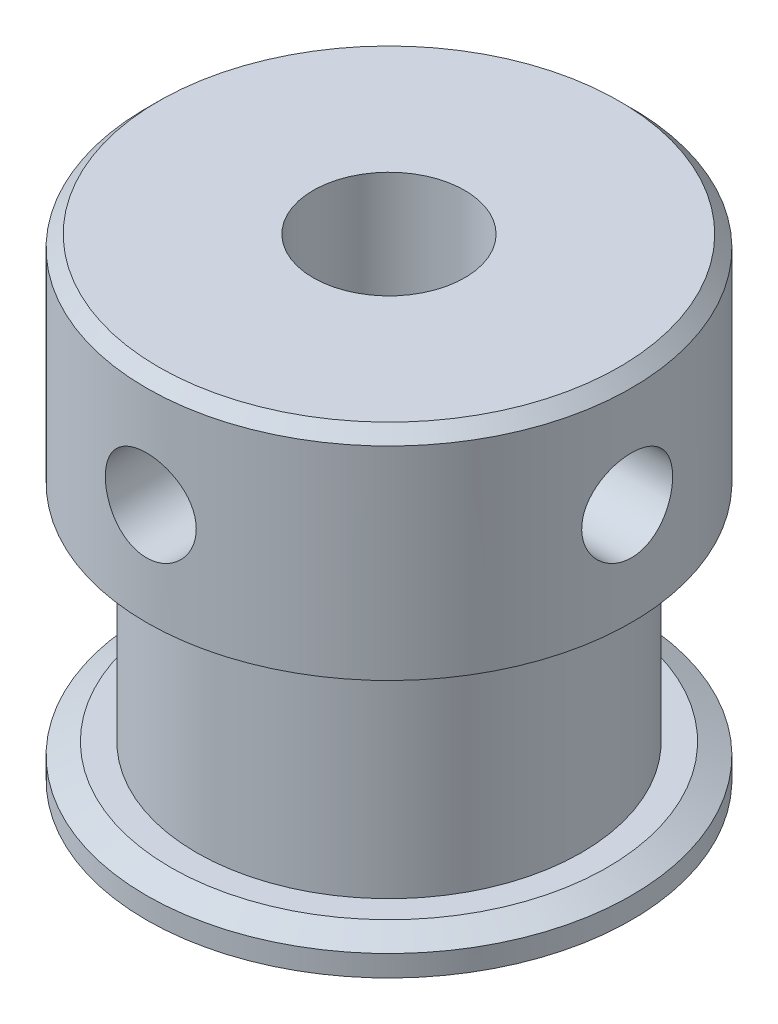
ISO-10303-21;
HEADER;
FILE_DESCRIPTION(('STEP AP214'),'2;1');
FILE_NAME('part.step','',(''),(''),'','','');
FILE_SCHEMA(('AUTOMOTIVE_DESIGN { 1 0 10303 214 1 1 1 1 }'));
ENDSEC;
DATA;
#1=APPLICATION_CONTEXT('core data for automotive mechanical design processes');
#2=APPLICATION_PROTOCOL_DEFINITION('international standard','automotive_design',2000,#1);
#3=PRODUCT_CONTEXT('',#1,'mechanical');
#4=PRODUCT('Part','Part','',(#3));
#5=PRODUCT_RELATED_PRODUCT_CATEGORY('part','',(#4));
#6=PRODUCT_DEFINITION_FORMATION('','',#4);
#7=PRODUCT_DEFINITION_CONTEXT('part definition',#1,'design');
#8=PRODUCT_DEFINITION('design','',#6,#7);
#9=PRODUCT_DEFINITION_SHAPE('','',#8);
#10=(LENGTH_UNIT() NAMED_UNIT(*) SI_UNIT(.MILLI.,.METRE.));
#11=(NAMED_UNIT(*) PLANE_ANGLE_UNIT() SI_UNIT($,.RADIAN.));
#12=(NAMED_UNIT(*) SI_UNIT($,.STERADIAN.) SOLID_ANGLE_UNIT());
#13=UNCERTAINTY_MEASURE_WITH_UNIT(LENGTH_MEASURE(1.E-05),#10,'distance_accuracy_value','');
#14=(GEOMETRIC_REPRESENTATION_CONTEXT(3) GLOBAL_UNCERTAINTY_ASSIGNED_CONTEXT((#13)) GLOBAL_UNIT_ASSIGNED_CONTEXT((#10,
#11,#12)) REPRESENTATION_CONTEXT('',''));
#15=CARTESIAN_POINT('',(0.,0.,0.));
#16=DIRECTION('',(0.,0.,1.));
#17=DIRECTION('',(1.,0.,0.));
#18=AXIS2_PLACEMENT_3D('',#15,#16,#17);
#19=CARTESIAN_POINT('',(0.,-3.15877434078088,0.));
#20=DIRECTION('',(0.,1.,0.));
#21=DIRECTION('',(0.,0.,1.));
#22=AXIS2_PLACEMENT_3D('',#19,#20,#21);
#23=CYLINDRICAL_SURFACE('',#22,2.5);
#24=CARTESIAN_POINT('',(0.,2.74999999999997,2.50000000000003));
#25=CARTESIAN_POINT('',(0.076729833462015,2.75000409100986,2.4999962578974));
#26=CARTESIAN_POINT('',(0.153582320644176,2.75592867092624,2.49642904615011));
#27=CARTESIAN_POINT('',(0.304975509530677,2.77932431951531,2.48249903608566));
#28=CARTESIAN_POINT('',(0.379510034596046,2.79682386185422,2.4721194803272));
#29=CARTESIAN_POINT('',(0.523751827790836,2.84238636116685,2.44561558054491));
#30=CARTESIAN_POINT('',(0.593481028226565,2.87039695816314,2.42951973272944));
#31=CARTESIAN_POINT('',(0.727030318214651,2.93586033314101,2.39295367626407));
#32=CARTESIAN_POINT('',(0.790851869416369,2.97331076696874,2.37248455380255));
#33=CARTESIAN_POINT('',(0.916299278999303,3.05977482670857,2.32705360719088));
#34=CARTESIAN_POINT('',(0.977384020081412,3.10945369535137,2.30186792195984));
#35=CARTESIAN_POINT('',(1.09088270411891,3.21746720382826,2.25030439279635));
#36=CARTESIAN_POINT('',(1.14328534948111,3.27581293718733,2.22392505153574));
#37=CARTESIAN_POINT('',(1.24444996762972,3.40792351049675,2.16911066995913));
#38=CARTESIAN_POINT('',(1.29197766378808,3.48270177098128,2.14082017703649));
#39=CARTESIAN_POINT('',(1.37361437764896,3.6408465732431,2.08938301412125));
#40=CARTESIAN_POINT('',(1.40774517335159,3.72419889624756,2.06622802273943));
#41=CARTESIAN_POINT('',(1.4544060171422,3.87659645065323,2.03354629660935));
#42=CARTESIAN_POINT('',(1.47016197246825,3.9442359986103,2.02207883137593));
#43=CARTESIAN_POINT('',(1.49216172340474,4.08180371583035,2.00590308295503));
#44=CARTESIAN_POINT('',(1.49841734556835,4.15172892875448,2.00118639643761));
#45=CARTESIAN_POINT('',(1.50105508796007,4.29201149421734,1.99920922463858));
#46=CARTESIAN_POINT('',(1.49741783408416,4.3623694250932,2.00196337012719));
#47=CARTESIAN_POINT('',(1.48046060478826,4.5012787754276,2.01453261443743));
#48=CARTESIAN_POINT('',(1.46713334620103,4.56982879584747,2.02435302432229));
#49=CARTESIAN_POINT('',(1.43173921881792,4.70253024212812,2.04953186944262));
#50=CARTESIAN_POINT('',(1.40978748666085,4.76672705392449,2.0648171165254));
#51=CARTESIAN_POINT('',(1.35795061770834,4.89069499092811,2.09927051350829));
#52=CARTESIAN_POINT('',(1.32806257259704,4.95046448342391,2.11844008623465));
#53=CARTESIAN_POINT('',(1.25517983184582,5.07498409712279,2.16255327268985));
#54=CARTESIAN_POINT('',(1.21080724397721,5.13877809295491,2.18792043372992));
#55=CARTESIAN_POINT('',(1.11291092784001,5.258676483667,2.23930599764383));
#56=CARTESIAN_POINT('',(1.05937845100577,5.3147734339765,2.26532500262153));
#57=CARTESIAN_POINT('',(0.935811834382951,5.42561298182175,2.3193550495832));
#58=CARTESIAN_POINT('',(0.864517682704924,5.47907730601597,2.34713836268533));
#59=CARTESIAN_POINT('',(0.712276050458969,5.5731220471979,2.39772428433982));
#60=CARTESIAN_POINT('',(0.631333763943552,5.61370935378997,2.4205295542552));
#61=CARTESIAN_POINT('',(0.467197585268199,5.6779321827959,2.45730392066155));
#62=CARTESIAN_POINT('',(0.384467624173561,5.70247535571589,2.47173957439704));
#63=CARTESIAN_POINT('',(0.215047895144617,5.73701119740536,2.49218842813551));
#64=CARTESIAN_POINT('',(0.128363005661304,5.74702131775358,2.49821172952742));
#65=CARTESIAN_POINT('',(-0.0337146143774014,5.75150784767831,2.50090570374615));
#66=CARTESIAN_POINT('',(-0.109042473418721,5.74790885508515,2.49873521714287));
#67=CARTESIAN_POINT('',(-0.257829401986068,5.72957414692806,2.48778712087047));
#68=CARTESIAN_POINT('',(-0.33128850937612,5.7148386571942,2.47900964518037));
#69=CARTESIAN_POINT('',(-0.472574932157623,5.67545656718755,2.4559479244219));
#70=CARTESIAN_POINT('',(-0.540495750928484,5.65105965092652,2.44180275662555));
#71=CARTESIAN_POINT('',(-0.671265749087264,5.59332262363471,2.40913880862845));
#72=CARTESIAN_POINT('',(-0.734113924963921,5.55998074865332,2.39061916586514));
#73=CARTESIAN_POINT('',(-0.860006262823877,5.48144302079129,2.34845496237363));
#74=CARTESIAN_POINT('',(-0.922394150456837,5.4353761709216,2.3244780273988));
#75=CARTESIAN_POINT('',(-1.03902603131013,5.33460860651137,2.27474265574732));
#76=CARTESIAN_POINT('',(-1.09326040273739,5.27989784514745,2.24898216586363));
#77=CARTESIAN_POINT('',(-1.1993199673558,5.15508960996284,2.19445423909894));
#78=CARTESIAN_POINT('',(-1.24991019630915,5.0839161145345,2.16573241746291));
#79=CARTESIAN_POINT('',(-1.33845238915667,4.9327839754318,2.1121618206671));
#80=CARTESIAN_POINT('',(-1.37641766769781,4.85283470610722,2.08730897997693));
#81=CARTESIAN_POINT('',(-1.43142578795777,4.70375697769332,2.04984909240521));
#82=CARTESIAN_POINT('',(-1.45121625336191,4.63601968764142,2.03575659328728));
#83=CARTESIAN_POINT('',(-1.48113663905972,4.49746792191989,2.01409605743543));
#84=CARTESIAN_POINT('',(-1.4912799529763,4.42665785567216,2.00651897642724));
#85=CARTESIAN_POINT('',(-1.50134130416631,4.28362305240295,1.9990044661627));
#86=CARTESIAN_POINT('',(-1.50122089107871,4.21139400931294,1.99909576445936));
#87=CARTESIAN_POINT('',(-1.49066472959329,4.06810556439055,2.00697717892849));
#88=CARTESIAN_POINT('',(-1.48022337215759,3.99704681991942,2.01477148138824));
#89=CARTESIAN_POINT('',(-1.45040174148913,3.86151158242783,2.03633185242984));
#90=CARTESIAN_POINT('',(-1.43147636845353,3.79688290569313,2.0497921180558));
#91=CARTESIAN_POINT('',(-1.38563242076995,3.67166274552577,2.08105501960149));
#92=CARTESIAN_POINT('',(-1.35871083588481,3.61107279303944,2.09885929040482));
#93=CARTESIAN_POINT('',(-1.29289245555734,3.48568014277921,2.14012990550917));
#94=CARTESIAN_POINT('',(-1.25279167675755,3.42165889614567,2.16404587582638));
#95=CARTESIAN_POINT('',(-1.16375698389086,3.3006199273827,2.21320127030767));
#96=CARTESIAN_POINT('',(-1.11481579607798,3.24360803784746,2.23844177205024));
#97=CARTESIAN_POINT('',(-1.00009777425734,3.12864905086834,2.29225690291479));
#98=CARTESIAN_POINT('',(-0.932876819313919,3.07206892510379,2.32070308663656));
#99=CARTESIAN_POINT('',(-0.788462434445615,2.97090214413668,2.37365428872367));
#100=CARTESIAN_POINT('',(-0.71126544450156,2.92631978801523,2.39815789310941));
#101=CARTESIAN_POINT('',(-0.551125230801472,2.85221419242628,2.43985578654398));
#102=CARTESIAN_POINT('',(-0.468430086957235,2.82227193507315,2.45725077479784));
#103=CARTESIAN_POINT('',(-0.29797330611883,2.777275304789,2.48366273001248));
#104=CARTESIAN_POINT('',(-0.210232099648633,2.76216483214303,2.49271125871498));
#105=CARTESIAN_POINT('',(-0.10155809691755,2.75330254529133,2.4980200116819));
#106=CARTESIAN_POINT('',(-0.0812762590282881,2.75206558269388,2.49876114656362));
#107=CARTESIAN_POINT('',(-0.0406658206871173,2.75041375362911,2.49975164517366));
#108=CARTESIAN_POINT('',(-0.0203372186375719,2.74999891567907,2.50000099184317));
#109=CARTESIAN_POINT('',(0.,2.74999999999997,2.50000000000003));
#110=B_SPLINE_CURVE_WITH_KNOTS('',3,(#24,#25,#26,#27,#28,#29,#30,#31,#32,#33,#34,#35,#36,#37,
#38,#39,#40,#41,#42,#43,#44,#45,#46,#47,#48,#49,#50,#51,#52,#53,#54,#55,#56,#57,#58,#59,#60,#61,
#62,#63,#64,#65,#66,#67,#68,#69,#70,#71,#72,#73,#74,#75,#76,#77,#78,#79,#80,#81,#82,#83,#84,#85,
#86,#87,#88,#89,#90,#91,#92,#93,#94,#95,#96,#97,#98,#99,#100,#101,#102,#103,#104,#105,#106,#107,
#108,#109),.UNSPECIFIED.,.T.,.F.,(4,2,2,2,2,2,2,2,2,2,2,2,2,2,2,2,2,2,2,2,2,2,2,2,2,2,2,2,2,2,2,
2,2,2,2,2,2,2,2,2,2,2,4),(0.,0.230102237548649,0.460772627520015,0.690308884600011,
0.919788197992268,1.16681590732472,1.41416257934801,1.69183813189807,1.9690604069209,
2.17933829855632,2.38935420916577,2.59978170870727,2.81036753273875,3.01823267593207,
3.22617409809866,3.47046995225161,3.71500044803674,3.99360957884691,4.27206939275324,
4.53296790696559,4.79355286918235,5.01875602722425,5.24395461863454,5.4636778568977,
5.68344445659024,5.9260136581836,6.16886690081834,6.44336762428007,6.71757792616452,
6.93257787314691,7.14727888733318,7.36278425777431,7.57840681155721,7.78364098331139,
7.98895251523033,8.22578610052284,8.46281544370206,8.73854311775516,9.01436946031982,
9.28175654462674,9.54812832184446,9.60911473335176,9.6701032602764),.UNSPECIFIED.);
#111=CARTESIAN_POINT('',(0.,2.74999999999997,2.50000000000003));
#112=VERTEX_POINT('',#111);
#113=EDGE_CURVE('E65',#112,#112,#110,.T.);
#114=ORIENTED_EDGE('',*,*,#113,.T.);
#115=EDGE_LOOP('',(#114));
#116=FACE_BOUND('',#115,.T.);
#117=CARTESIAN_POINT('',(0.,8.00000000000001,0.));
#118=DIRECTION('',(0.,1.,0.));
#119=DIRECTION('',(0.,0.,1.));
#120=AXIS2_PLACEMENT_3D('',#117,#118,#119);
#121=CIRCLE('',#120,2.5);
#122=CARTESIAN_POINT('',(0.,8.00000000000001,2.5));
#123=VERTEX_POINT('',#122);
#124=EDGE_CURVE('E143',#123,#123,#121,.T.);
#125=ORIENTED_EDGE('',*,*,#124,.T.);
#126=EDGE_LOOP('',(#125));
#127=FACE_BOUND('',#126,.T.);
#128=CARTESIAN_POINT('',(0.,-8.00000000000001,0.));
#129=DIRECTION('',(0.,1.,0.));
#130=DIRECTION('',(0.,0.,1.));
#131=AXIS2_PLACEMENT_3D('',#128,#129,#130);
#132=CIRCLE('',#131,2.5);
#133=CARTESIAN_POINT('',(0.,-8.00000000000001,2.5));
#134=VERTEX_POINT('',#133);
#135=EDGE_CURVE('E146',#134,#134,#132,.T.);
#136=ORIENTED_EDGE('',*,*,#135,.F.);
#137=EDGE_LOOP('',(#136));
#138=FACE_BOUND('',#137,.T.);
#139=CARTESIAN_POINT('',(2.,4.24999999999998,-1.49999999999997));
#140=CARTESIAN_POINT('',(1.99999416642512,4.32547897528962,-1.50000404108589));
#141=CARTESIAN_POINT('',(2.00433633903482,4.40093843407979,-1.49426852824013));
#142=CARTESIAN_POINT('',(2.02092590613883,4.54932390396221,-1.47174965152787));
#143=CARTESIAN_POINT('',(2.03318155043096,4.6222471873851,-1.45495475788933));
#144=CARTESIAN_POINT('',(2.06362339034729,4.76308364167728,-1.41143486335791));
#145=CARTESIAN_POINT('',(2.0817666618312,4.83102883803527,-1.38478154503148));
#146=CARTESIAN_POINT('',(2.12185904995837,4.96143745336793,-1.32252909283018));
#147=CARTESIAN_POINT('',(2.14380930122415,5.02389922969515,-1.28692729054691));
#148=CARTESIAN_POINT('',(2.19228594587542,5.14994901666409,-1.20271292747641));
#149=CARTESIAN_POINT('',(2.21904371037663,5.21274095712394,-1.15304179435286));
#150=CARTESIAN_POINT('',(2.27226229431061,5.32976476274175,-1.04426801309983));
#151=CARTESIAN_POINT('',(2.29872287517102,5.38399015167081,-0.985158296729596));
#152=CARTESIAN_POINT('',(2.35175567858733,5.4881338097097,-0.851442367411684));
#153=CARTESIAN_POINT('',(2.37803133577818,5.53695446366974,-0.775851995162527));
#154=CARTESIAN_POINT('',(2.4244378698318,5.62080972244441,-0.615654228271633));
#155=CARTESIAN_POINT('',(2.44457437988734,5.6558569741227,-0.531055196626303));
#156=CARTESIAN_POINT('',(2.47470987800439,5.70759592281263,-0.363771406742636));
#157=CARTESIAN_POINT('',(2.4854930393917,5.72572036096728,-0.281674698130883));
#158=CARTESIAN_POINT('',(2.49874939277546,5.7479428028631,-0.114970509382669));
#159=CARTESIAN_POINT('',(2.50123038813307,5.75205397800004,-0.0303654624001093));
#160=CARTESIAN_POINT('',(2.49783372711538,5.74638625265751,0.127637283737351));
#161=CARTESIAN_POINT('',(2.49295437513726,5.73826647383065,0.201123832865669));
#162=CARTESIAN_POINT('',(2.47707997553857,5.71152020435188,0.345464269151799));
#163=CARTESIAN_POINT('',(2.46608447529307,5.69289293609286,0.416317961051237));
#164=CARTESIAN_POINT('',(2.43884907201718,5.64583443729624,0.554056780469106));
#165=CARTESIAN_POINT('',(2.42257910450823,5.61734693886098,0.62091649103763));
#166=CARTESIAN_POINT('',(2.38609637638748,5.55161538377442,0.748988660115624));
#167=CARTESIAN_POINT('',(2.36588259201812,5.51436905294097,0.810199646208039));
#168=CARTESIAN_POINT('',(2.32037925976363,5.42716090719554,0.933074267143223));
#169=CARTESIAN_POINT('',(2.2947718295215,5.37621168826423,0.993918663198196));
#170=CARTESIAN_POINT('',(2.24255554245601,5.2655958821398,1.10671465909275));
#171=CARTESIAN_POINT('',(2.21594536703374,5.2059174965255,1.15865401308342));
#172=CARTESIAN_POINT('',(2.16111075123945,5.07134659383646,1.25824837767419));
#173=CARTESIAN_POINT('',(2.13305661385124,4.99549242346052,1.30470933188631));
#174=CARTESIAN_POINT('',(2.08250879557267,4.83529376836336,1.38397217194233));
#175=CARTESIAN_POINT('',(2.0600049029882,4.75096528387434,1.41679921962194));
#176=CARTESIAN_POINT('',(2.0289586519673,4.59760636810463,1.46077497064846));
#177=CARTESIAN_POINT('',(2.01833888618315,4.52995936770333,1.47527903312665));
#178=CARTESIAN_POINT('',(2.00392150777558,4.39262638970049,1.49480872755283));
#179=CARTESIAN_POINT('',(2.00011596115117,4.32294287951541,1.49984538302909));
#180=CARTESIAN_POINT('',(1.99988914321324,4.18344831756427,1.50014781114185));
#181=CARTESIAN_POINT('',(2.00347810223985,4.11363722278477,1.49540004697658));
#182=CARTESIAN_POINT('',(2.01751520788651,3.97601265625143,1.47640290574942));
#183=CARTESIAN_POINT('',(2.02796877613211,3.90820080775973,1.46214601830143));
#184=CARTESIAN_POINT('',(2.05431768333099,3.77628542052021,1.42488312618661));
#185=CARTESIAN_POINT('',(2.07020622092811,3.71217736346778,1.40188805257364));
#186=CARTESIAN_POINT('',(2.10571539417586,3.58852228426984,1.34796261057074));
#187=CARTESIAN_POINT('',(2.12533743689997,3.52897699363402,1.31702924888214));
#188=CARTESIAN_POINT('',(2.17036819177734,3.40475991748778,1.24167439558516));
#189=CARTESIAN_POINT('',(2.19618239397367,3.34109916490345,1.19582663060306));
#190=CARTESIAN_POINT('',(2.24821754803619,3.22171451515056,1.09487395518704));
#191=CARTESIAN_POINT('',(2.27443886711454,3.16599830783091,1.03976018672406));
#192=CARTESIAN_POINT('',(2.32835625910913,3.05677599264958,0.913274837212802));
#193=CARTESIAN_POINT('',(2.35580075875869,3.00449927339416,0.840721108780227));
#194=CARTESIAN_POINT('',(2.40537639133457,2.91309722316334,0.686103100868041));
#195=CARTESIAN_POINT('',(2.42751104449409,2.87396317215908,0.604045176134709));
#196=CARTESIAN_POINT('',(2.46252280092774,2.81313179656863,0.438840232972137));
#197=CARTESIAN_POINT('',(2.47595588067329,2.79037377220887,0.356205963651264));
#198=CARTESIAN_POINT('',(2.494407389061,2.75928539715373,0.187383063890864));
#199=CARTESIAN_POINT('',(2.49943534582737,2.7509387092824,0.10119857178197));
#200=CARTESIAN_POINT('',(2.50040600461975,2.74932539141409,-0.0598120232009884));
#201=CARTESIAN_POINT('',(2.49747057186327,2.75419666543696,-0.134620583589711));
#202=CARTESIAN_POINT('',(2.48512948412096,2.77489382438158,-0.282148755978776));
#203=CARTESIAN_POINT('',(2.4757237570664,2.79071983132157,-0.354868344701912));
#204=CARTESIAN_POINT('',(2.45149427526963,2.83221957158376,-0.495145481978789));
#205=CARTESIAN_POINT('',(2.43675966858907,2.85773159612921,-0.562767032608821));
#206=CARTESIAN_POINT('',(2.40303337447155,2.91764059455472,-0.692781971999954));
#207=CARTESIAN_POINT('',(2.38404073252267,2.95203956085959,-0.755174184199782));
#208=CARTESIAN_POINT('',(2.34093432659379,3.03292519656874,-0.880263645295901));
#209=CARTESIAN_POINT('',(2.31648844639149,3.08031870901683,-0.94225869043992));
#210=CARTESIAN_POINT('',(2.26601907350662,3.18375303371768,-1.05789751536305));
#211=CARTESIAN_POINT('',(2.23999385274509,3.23980342560788,-1.11153190956913));
#212=CARTESIAN_POINT('',(2.18528165666203,3.36728556217769,-1.21590975350567));
#213=CARTESIAN_POINT('',(2.156675662709,3.43976648616548,-1.26542406663368));
#214=CARTESIAN_POINT('',(2.10376464485145,3.59348485276653,-1.35156817210326));
#215=CARTESIAN_POINT('',(2.07945738811052,3.67471771398143,-1.3882046632266));
#216=CARTESIAN_POINT('',(2.0408000304796,3.83706428513722,-1.44437116535131));
#217=CARTESIAN_POINT('',(2.02577665830138,3.91759523596125,-1.46509526060188));
#218=CARTESIAN_POINT('',(2.00539032320036,4.08209739470367,-1.49289268240426));
#219=CARTESIAN_POINT('',(2.00000648744643,4.16606076575869,-1.49999550595834));
#220=CARTESIAN_POINT('',(2.,4.24999999999998,-1.49999999999997));
#221=B_SPLINE_CURVE_WITH_KNOTS('',3,(#139,#140,#141,#142,#143,#144,#145,#146,#147,#148,#149,
#150,#151,#152,#153,#154,#155,#156,#157,#158,#159,#160,#161,#162,#163,#164,#165,#166,#167,#168,
#169,#170,#171,#172,#173,#174,#175,#176,#177,#178,#179,#180,#181,#182,#183,#184,#185,#186,#187,
#188,#189,#190,#191,#192,#193,#194,#195,#196,#197,#198,#199,#200,#201,#202,#203,#204,#205,#206,
#207,#208,#209,#210,#211,#212,#213,#214,#215,#216,#217,#218,#219,#220),.UNSPECIFIED.,.T.,.F.,(4,
2,2,2,2,2,2,2,2,2,2,2,2,2,2,2,2,2,2,2,2,2,2,2,2,2,2,2,2,2,2,2,2,2,2,2,2,2,2,2,4),(0.,
0.226085249493408,0.452406574330803,0.677113624991908,0.901887762215965,1.15414462390004,
1.40659128601846,1.68630157736225,1.96575443271222,2.218533308585,2.47107452602771,
2.69230130543184,2.91354445887946,3.13607155036378,3.3586564836888,3.6078281005585,
3.85733966656907,4.13576671140277,4.4136776015477,4.62276298054686,4.83160475643979,
5.04073566011183,5.25003193304128,5.45906724365493,5.66818149154657,5.91499438481999,
6.16204457978451,6.44121828011587,6.72020638384849,6.97891479383339,7.23732973022728,
7.46129321849401,7.68525920139649,7.90563970188755,8.12606965394582,8.37042963549485,
8.61506198741954,8.89071695766605,9.1662283248481,9.41820120134356,9.66962780912277),.UNSPECIFIED.);
#222=CARTESIAN_POINT('',(2.,4.24999999999998,-1.49999999999997));
#223=VERTEX_POINT('',#222);
#224=EDGE_CURVE('E74',#223,#223,#221,.T.);
#225=ORIENTED_EDGE('',*,*,#224,.T.);
#226=EDGE_LOOP('',(#225));
#227=FACE_BOUND('',#226,.T.);
#228=ADVANCED_FACE('F14',(#116,#127,#138,#227),#23,.F.);
#229=CARTESIAN_POINT('',(0.,-3.15877434078088,0.));
#230=DIRECTION('',(0.,1.,0.));
#231=DIRECTION('',(0.,0.,1.));
#232=AXIS2_PLACEMENT_3D('',#229,#230,#231);
#233=CYLINDRICAL_SURFACE('',#232,8.);
#234=CARTESIAN_POINT('',(0.,7.6,0.));
#235=DIRECTION('',(0.,1.,0.));
#236=DIRECTION('',(0.,0.,1.));
#237=AXIS2_PLACEMENT_3D('',#234,#235,#236);
#238=CIRCLE('',#237,8.);
#239=CARTESIAN_POINT('',(0.,7.6,8.));
#240=VERTEX_POINT('',#239);
#241=EDGE_CURVE('E35',#240,#240,#238,.F.);
#242=ORIENTED_EDGE('',*,*,#241,.T.);
#243=EDGE_LOOP('',(#242));
#244=FACE_BOUND('',#243,.T.);
#245=CARTESIAN_POINT('',(0.,0.900000000000012,0.));
#246=DIRECTION('',(0.,-1.,0.));
#247=DIRECTION('',(0.,0.,-1.));
#248=AXIS2_PLACEMENT_3D('',#245,#246,#247);
#249=CIRCLE('',#248,8.);
#250=CARTESIAN_POINT('',(0.,0.900000000000012,-8.));
#251=VERTEX_POINT('',#250);
#252=EDGE_CURVE('E153',#251,#251,#249,.F.);
#253=ORIENTED_EDGE('',*,*,#252,.T.);
#254=EDGE_LOOP('',(#253));
#255=FACE_BOUND('',#254,.T.);
#256=CARTESIAN_POINT('',(0.,2.74999999999997,8.00000000000001));
#257=CARTESIAN_POINT('',(-0.0834717464654839,2.75000318958825,7.99999848833853));
#258=CARTESIAN_POINT('',(-0.166984992730111,2.75699107661935,7.99868009921714));
#259=CARTESIAN_POINT('',(-0.331658129841805,2.78473999511833,7.99354785890521));
#260=CARTESIAN_POINT('',(-0.412815974152228,2.80551265063973,7.989731901669));
#261=CARTESIAN_POINT('',(-0.570372961851811,2.86017270125933,7.98003138765461));
#262=CARTESIAN_POINT('',(-0.646776330685366,2.89404825245252,7.97414869946483));
#263=CARTESIAN_POINT('',(-0.792807973094031,2.97391887692281,7.96095710599783));
#264=CARTESIAN_POINT('',(-0.862436794477338,3.01991296914484,7.95364831618291));
#265=CARTESIAN_POINT('',(-0.993783715930519,3.1232997680037,7.93831336430506));
#266=CARTESIAN_POINT('',(-1.05540895503186,3.18080944467014,7.93028034856351));
#267=CARTESIAN_POINT('',(-1.16819606135373,3.30534330908755,7.9144531845865));
#268=CARTESIAN_POINT('',(-1.21935717689244,3.37236817976928,7.90665905354529));
#269=CARTESIAN_POINT('',(-1.31014998665795,3.51468608836397,7.89212551245007));
#270=CARTESIAN_POINT('',(-1.34968721969608,3.59004037031723,7.88539493886181));
#271=CARTESIAN_POINT('',(-1.41550524332285,3.74646891517679,7.87384713211987));
#272=CARTESIAN_POINT('',(-1.441787177131,3.82754268411123,7.86902973396965));
#273=CARTESIAN_POINT('',(-1.48005053503502,3.99211523091442,7.86192269574552));
#274=CARTESIAN_POINT('',(-1.4921939019204,4.07557509720347,7.85960445366404));
#275=CARTESIAN_POINT('',(-1.50233808095348,4.24337738480824,7.85767197152761));
#276=CARTESIAN_POINT('',(-1.50034016135376,4.32771972630229,7.85805748898762));
#277=CARTESIAN_POINT('',(-1.48238979602364,4.49371952526602,7.86146292701756));
#278=CARTESIAN_POINT('',(-1.46662149996046,4.57539771430013,7.86444808147334));
#279=CARTESIAN_POINT('',(-1.42186799396208,4.73492841978258,7.87266183284666));
#280=CARTESIAN_POINT('',(-1.39288222239501,4.81278077350928,7.87789052509517));
#281=CARTESIAN_POINT('',(-1.32233647179301,4.96298867900024,7.8900385529259));
#282=CARTESIAN_POINT('',(-1.28070213532456,5.03530847058078,7.89696783823366));
#283=CARTESIAN_POINT('',(-1.18609368930417,5.17200472854022,7.91172971602918));
#284=CARTESIAN_POINT('',(-1.13311842889269,5.23638038771481,7.91956240015523));
#285=CARTESIAN_POINT('',(-1.016339056853,5.35642495567246,7.93540001272165));
#286=CARTESIAN_POINT('',(-0.95237743686069,5.41194065245172,7.94340571024029));
#287=CARTESIAN_POINT('',(-0.815968037098836,5.51147724067539,7.95857386108319));
#288=CARTESIAN_POINT('',(-0.743520172255799,5.55549801687043,7.96573630595249));
#289=CARTESIAN_POINT('',(-0.592034988874701,5.63081775387002,7.97842539677513));
#290=CARTESIAN_POINT('',(-0.512989564446508,5.66210077911787,7.98394999136289));
#291=CARTESIAN_POINT('',(-0.350639115398698,5.71090209309214,7.99272505402719));
#292=CARTESIAN_POINT('',(-0.267334544277794,5.72842184404537,7.99597576367998));
#293=CARTESIAN_POINT('',(-0.100148652903401,5.74898603101828,7.99980360641985));
#294=CARTESIAN_POINT('',(-0.0162940126341547,5.7522403915297,8.00041950912279));
#295=CARTESIAN_POINT('',(0.150761248092161,5.74474452045233,7.99901543598228));
#296=CARTESIAN_POINT('',(0.233961900480363,5.73399497693476,7.99699558964435));
#297=CARTESIAN_POINT('',(0.396681573218187,5.69897096481666,7.9905711150041));
#298=CARTESIAN_POINT('',(0.476224261046024,5.67480271746218,7.98618522374032));
#299=CARTESIAN_POINT('',(0.6301286318246,5.61374229322119,7.97551842212498));
#300=CARTESIAN_POINT('',(0.704489962595084,5.57684925243422,7.96923738311336));
#301=CARTESIAN_POINT('',(0.8468166715132,5.4909218718405,7.95538030357668));
#302=CARTESIAN_POINT('',(0.914703277015096,5.44175926146316,7.94779086174562));
#303=CARTESIAN_POINT('',(1.04133832326451,5.33286186263762,7.93219343489712));
#304=CARTESIAN_POINT('',(1.10008590976084,5.27312608699865,7.92418541084691));
#305=CARTESIAN_POINT('',(1.20757295872046,5.14382768108856,7.90852475697454));
#306=CARTESIAN_POINT('',(1.25616916218574,5.0741450918746,7.90087825860258));
#307=CARTESIAN_POINT('',(1.34096675057785,4.92748237547624,7.88692985578532));
#308=CARTESIAN_POINT('',(1.37716859613922,4.85050251962952,7.88062790137352));
#309=CARTESIAN_POINT('',(1.43594673512821,4.69179413275746,7.87013024209576));
#310=CARTESIAN_POINT('',(1.45858868794784,4.61009062044067,7.86592440436879));
#311=CARTESIAN_POINT('',(1.48980679326234,4.44395277747861,7.86007203802416));
#312=CARTESIAN_POINT('',(1.49838453270707,4.35951875602962,7.85842522065793));
#313=CARTESIAN_POINT('',(1.50117762148354,4.19175166855851,7.85789199803861));
#314=CARTESIAN_POINT('',(1.49561895003498,4.10842241904302,7.85896215974294));
#315=CARTESIAN_POINT('',(1.47079175378802,3.94390857795471,7.86364600659998));
#316=CARTESIAN_POINT('',(1.45152331089331,3.86272397357255,7.86725967655748));
#317=CARTESIAN_POINT('',(1.39991887583262,3.7049255152045,7.87660508023181));
#318=CARTESIAN_POINT('',(1.36760735397251,3.62830340865421,7.88233284594964));
#319=CARTESIAN_POINT('',(1.29085868912203,3.48153174575913,7.89526387551841));
#320=CARTESIAN_POINT('',(1.24642068948185,3.41138264715519,7.90246724360124));
#321=CARTESIAN_POINT('',(1.14589487339535,3.27841631995768,7.9176726610775));
#322=CARTESIAN_POINT('',(1.08964259864304,3.21572458743287,7.92568505353044));
#323=CARTESIAN_POINT('',(0.967427926742284,3.10059483753547,7.94152833918735));
#324=CARTESIAN_POINT('',(0.901463301891599,3.04815917901989,7.94935919027331));
#325=CARTESIAN_POINT('',(0.760984945071856,2.95458904737296,7.96403975968052));
#326=CARTESIAN_POINT('',(0.686399590640508,2.91356057150935,7.97088000990561));
#327=CARTESIAN_POINT('',(0.531290113653829,2.84468236339483,7.98271619380687));
#328=CARTESIAN_POINT('',(0.450771651705238,2.81682025295307,7.98771385879041));
#329=CARTESIAN_POINT('',(0.30834720282514,2.78072268558131,7.99428290707635));
#330=CARTESIAN_POINT('',(0.247273810251857,2.76922136968718,7.99641470878207));
#331=CARTESIAN_POINT('',(0.124141247115144,2.75385893788353,7.9992737995401));
#332=CARTESIAN_POINT('',(0.0620821016526959,2.74999762774407,8.00000112429805));
#333=CARTESIAN_POINT('',(0.,2.74999999999997,8.00000000000001));
#334=B_SPLINE_CURVE_WITH_KNOTS('',3,(#256,#257,#258,#259,#260,#261,#262,#263,#264,#265,#266,
#267,#268,#269,#270,#271,#272,#273,#274,#275,#276,#277,#278,#279,#280,#281,#282,#283,#284,#285,
#286,#287,#288,#289,#290,#291,#292,#293,#294,#295,#296,#297,#298,#299,#300,#301,#302,#303,#304,
#305,#306,#307,#308,#309,#310,#311,#312,#313,#314,#315,#316,#317,#318,#319,#320,#321,#322,#323,
#324,#325,#326,#327,#328,#329,#330,#331,#332,#333),.UNSPECIFIED.,.T.,.F.,(4,2,2,2,2,2,2,2,2,2,2,
2,2,2,2,2,2,2,2,2,2,2,2,2,2,2,2,2,2,2,2,2,2,2,2,2,2,2,4),(0.,0.250188200964921,
0.500587642535443,0.750761271230916,1.00091465336894,1.25375118013632,1.50660586283617,
1.76146190504359,2.01629596311952,2.26818151445337,2.52004447587255,2.76859000612765,
3.01714609846786,3.26719262629531,3.5172645404986,3.77127768464077,4.02529337544947,
4.27962588321699,4.53393136673747,4.78448174076097,5.03501980464582,5.28360233907828,
5.53220175338032,5.78351778017709,6.03485728413099,6.289534369873,6.54420198954945,
6.79762627818557,7.0510219694651,7.30039252231747,7.54976158541508,7.79866496207695,
8.04758592655425,8.30023369966381,8.55293951262255,8.80792048916315,9.06266126931175,
9.24874344524411,9.43482089039542),.UNSPECIFIED.);
#335=CARTESIAN_POINT('',(0.,2.74999999999997,8.00000000000001));
#336=VERTEX_POINT('',#335);
#337=EDGE_CURVE('E27',#336,#336,#334,.T.);
#338=ORIENTED_EDGE('',*,*,#337,.T.);
#339=EDGE_LOOP('',(#338));
#340=FACE_BOUND('',#339,.T.);
#341=CARTESIAN_POINT('',(7.85811682275087,4.24999999999998,-1.5));
#342=CARTESIAN_POINT('',(7.85811843793495,4.16654279198823,-1.49999679883246));
#343=CARTESIAN_POINT('',(7.85946079760267,4.08304405178158,-1.49301126348936));
#344=CARTESIAN_POINT('',(7.86467851014364,3.91840103841807,-1.46527253251804));
#345=CARTESIAN_POINT('',(7.86855601173206,3.8372588235725,-1.44450765768474));
#346=CARTESIAN_POINT('',(7.87838976464885,3.6797349286291,-1.38987035617785));
#347=CARTESIAN_POINT('',(7.88434407905997,3.60334889069268,-1.35601013954374));
#348=CARTESIAN_POINT('',(7.89765826320959,3.45734644071317,-1.27617565760365));
#349=CARTESIAN_POINT('',(7.90501802325622,3.38772950099672,-1.23020233759189));
#350=CARTESIAN_POINT('',(7.92041614838945,3.25636980080088,-1.12683678942618));
#351=CARTESIAN_POINT('',(7.92846116625679,3.19472351652825,-1.06932292933091));
#352=CARTESIAN_POINT('',(7.94426457664033,3.08189561040041,-0.944771778803558));
#353=CARTESIAN_POINT('',(7.95202295031152,3.0307146755752,-0.877733863624929));
#354=CARTESIAN_POINT('',(7.96645017828404,2.93990062339948,-0.735403894570135));
#355=CARTESIAN_POINT('',(7.97311028052362,2.90035846648055,-0.660052840033848));
#356=CARTESIAN_POINT('',(7.98451608632931,2.83453045772643,-0.50363128325075));
#357=CARTESIAN_POINT('',(7.98926194728335,2.80824351600975,-0.422561251859487));
#358=CARTESIAN_POINT('',(7.99625755123779,2.76997045138884,-0.258002746187392));
#359=CARTESIAN_POINT('',(7.99853565976327,2.75782169407728,-0.174553323244834));
#360=CARTESIAN_POINT('',(8.00043684615594,2.74766311229959,-0.0067716760353607));
#361=CARTESIAN_POINT('',(8.00006015010696,2.74965208386097,0.0775604724476919));
#362=CARTESIAN_POINT('',(7.9967163376324,2.76758777114717,0.243598357899428));
#363=CARTESIAN_POINT('',(7.99378172247213,2.78335936943,0.325323760451512));
#364=CARTESIAN_POINT('',(7.98568826333561,2.82813564939522,0.484947165715519));
#365=CARTESIAN_POINT('',(7.98052933829965,2.85714081334582,0.562845028826575));
#366=CARTESIAN_POINT('',(7.96851260297338,2.92772773105833,0.713110065751556));
#367=CARTESIAN_POINT('',(7.96164537590825,2.96937948791251,0.785443571838577));
#368=CARTESIAN_POINT('',(7.94697147542849,3.06402566907716,0.922159977214679));
#369=CARTESIAN_POINT('',(7.93916470651163,3.1170212468876,0.986542066910814));
#370=CARTESIAN_POINT('',(7.92333513680565,3.23381570298356,1.10656561896906));
#371=CARTESIAN_POINT('',(7.91531085901621,3.29776778390209,1.16205790757043));
#372=CARTESIAN_POINT('',(7.90006508924621,3.43414953127863,1.26155171851263));
#373=CARTESIAN_POINT('',(7.89284360901351,3.50657932176463,1.30555307271185));
#374=CARTESIAN_POINT('',(7.88001893307122,3.65805827070265,1.3808585222448));
#375=CARTESIAN_POINT('',(7.87441850530261,3.73711845719064,1.41214093645422));
#376=CARTESIAN_POINT('',(7.86551242396689,3.89950118412319,1.46093656975056));
#377=CARTESIAN_POINT('',(7.86220651038621,3.98282324046477,1.47845134901109));
#378=CARTESIAN_POINT('',(7.85831520301006,4.15001932885587,1.4989967264974));
#379=CARTESIAN_POINT('',(7.85768955816137,4.2338661155655,1.50224164285857));
#380=CARTESIAN_POINT('',(7.8591219142084,4.40090345508715,1.49472968881726));
#381=CARTESIAN_POINT('',(7.86117978238611,4.48409404014809,1.48397351086438));
#382=CARTESIAN_POINT('',(7.86770980063205,4.64675290305439,1.44894868195887));
#383=CARTESIAN_POINT('',(7.87216186690878,4.72624625262488,1.42479238583989));
#384=CARTESIAN_POINT('',(7.88296134156619,4.88005718973015,1.36377224379059));
#385=CARTESIAN_POINT('',(7.88930888963281,4.95437439531535,1.32690746128799));
#386=CARTESIAN_POINT('',(7.90327577863685,5.09666761904318,1.24102353119665));
#387=CARTESIAN_POINT('',(7.91090895425315,5.16456053786605,1.19186899639621));
#388=CARTESIAN_POINT('',(7.926548113681,5.29121204021431,1.08298344344246));
#389=CARTESIAN_POINT('',(7.93455413096494,5.34996980155578,1.02325147433085));
#390=CARTESIAN_POINT('',(7.95016624005946,5.45748376353412,0.893949417870415));
#391=CARTESIAN_POINT('',(7.95776555833305,5.50609582660593,0.824258534095907));
#392=CARTESIAN_POINT('',(7.97159404810351,5.59092120617763,0.677574523040161));
#393=CARTESIAN_POINT('',(7.97782327234725,5.62713500002499,0.600581677038567));
#394=CARTESIAN_POINT('',(7.98818057995848,5.68592009786407,0.441877541578727));
#395=CARTESIAN_POINT('',(7.99231954730142,5.70856218756138,0.360193213079017));
#396=CARTESIAN_POINT('',(7.99807642083745,5.73978704828987,0.194096227381581));
#397=CARTESIAN_POINT('',(7.99969459229934,5.74837129866272,0.109683858215857));
#398=CARTESIAN_POINT('',(8.00022227515442,5.75118530151845,-0.0580907602504993));
#399=CARTESIAN_POINT('',(7.99917286625032,5.74563275312951,-0.14144930706625));
#400=CARTESIAN_POINT('',(7.99456866611702,5.72080757223154,-0.30602336927917));
#401=CARTESIAN_POINT('',(7.99101389890671,5.70153507125579,-0.387238905213657));
#402=CARTESIAN_POINT('',(7.98179837978045,5.6499087926163,-0.545106475595448));
#403=CARTESIAN_POINT('',(7.97614135981576,5.617578187119,-0.621766319318185));
#404=CARTESIAN_POINT('',(7.96333372068771,5.54077954634481,-0.768605631316655));
#405=CARTESIAN_POINT('',(7.95618300146483,5.49631069789334,-0.838784665003233));
#406=CARTESIAN_POINT('',(7.94104779859941,5.39574854555767,-0.971755027779978));
#407=CARTESIAN_POINT('',(7.93305284591272,5.33949796613829,-1.03442623539051));
#408=CARTESIAN_POINT('',(7.91719633538833,5.21729543750729,-1.14951536065483));
#409=CARTESIAN_POINT('',(7.90933480936765,5.15134120962627,-1.20193086324777));
#410=CARTESIAN_POINT('',(7.89455577425926,5.01087354529666,-1.29547633945382));
#411=CARTESIAN_POINT('',(7.88764767280729,4.93628656033238,-1.3364974053187));
#412=CARTESIAN_POINT('',(7.87567084650033,4.78117421002029,-1.40536132423414));
#413=CARTESIAN_POINT('',(7.87060038649116,4.70065453341064,-1.43321661638906));
#414=CARTESIAN_POINT('',(7.86393016292125,4.55824771193411,-1.46929726596171));
#415=CARTESIAN_POINT('',(7.86176310717932,4.49719427623807,-1.48079105739849));
#416=CARTESIAN_POINT('',(7.85885585595505,4.37410153157968,-1.49614351076216));
#417=CARTESIAN_POINT('',(7.85811562163283,4.31206224949966,-1.50000238052127));
#418=CARTESIAN_POINT('',(7.85811682275087,4.24999999999998,-1.5));
#419=B_SPLINE_CURVE_WITH_KNOTS('',3,(#341,#342,#343,#344,#345,#346,#347,#348,#349,#350,#351,
#352,#353,#354,#355,#356,#357,#358,#359,#360,#361,#362,#363,#364,#365,#366,#367,#368,#369,#370,
#371,#372,#373,#374,#375,#376,#377,#378,#379,#380,#381,#382,#383,#384,#385,#386,#387,#388,#389,
#390,#391,#392,#393,#394,#395,#396,#397,#398,#399,#400,#401,#402,#403,#404,#405,#406,#407,#408,
#409,#410,#411,#412,#413,#414,#415,#416,#417,#418),.UNSPECIFIED.,.T.,.F.,(4,2,2,2,2,2,2,2,2,2,2,
2,2,2,2,2,2,2,2,2,2,2,2,2,2,2,2,2,2,2,2,2,2,2,2,2,2,2,4),(0.,0.250144505793188,0.5005013023804,
0.750625227978428,1.00072963993906,1.25362335698689,1.50653367069313,1.76137104348047,
2.0161874593964,2.26804275460261,2.51987660200649,2.76855650598726,3.01724547328427,
3.26733691984221,3.51745380911787,3.77140614764065,4.02536220192399,4.27974936118265,
4.53410768866485,4.78463248587074,5.03514489338717,5.28358792315367,5.53204926624316,
5.78337862654142,6.03473059394676,6.28944125495867,6.544142108217,6.79750269418681,
7.0508366166733,7.30029300570136,7.54974700322163,7.79876026530354,8.04779021357107,
8.30038464008742,8.55303847730762,8.80803001818113,9.06278015749112,9.24880307527211,
9.43482092920424),.UNSPECIFIED.);
#420=CARTESIAN_POINT('',(7.85811682275087,4.24999999999998,-1.5));
#421=VERTEX_POINT('',#420);
#422=EDGE_CURVE('E10',#421,#421,#419,.T.);
#423=ORIENTED_EDGE('',*,*,#422,.T.);
#424=EDGE_LOOP('',(#423));
#425=FACE_BOUND('',#424,.T.);
#426=ADVANCED_FACE('F50',(#244,#255,#340,#425),#233,.T.);
#427=CARTESIAN_POINT('',(0.,-3.15877434078088,0.));
#428=DIRECTION('',(0.,1.,0.));
#429=DIRECTION('',(0.,0.,1.));
#430=AXIS2_PLACEMENT_3D('',#427,#428,#429);
#431=CYLINDRICAL_SURFACE('',#430,8.);
#432=CARTESIAN_POINT('',(0.,-6.90000000000002,0.));
#433=DIRECTION('',(0.,1.,0.));
#434=DIRECTION('',(0.,0.,1.));
#435=AXIS2_PLACEMENT_3D('',#432,#433,#434);
#436=CIRCLE('',#435,8.);
#437=CARTESIAN_POINT('',(0.,-6.90000000000002,8.));
#438=VERTEX_POINT('',#437);
#439=EDGE_CURVE('E117',#438,#438,#436,.F.);
#440=ORIENTED_EDGE('',*,*,#439,.T.);
#441=EDGE_LOOP('',(#440));
#442=FACE_BOUND('',#441,.T.);
#443=CARTESIAN_POINT('',(0.,-7.6,0.));
#444=DIRECTION('',(0.,-1.,0.));
#445=DIRECTION('',(0.,0.,-1.));
#446=AXIS2_PLACEMENT_3D('',#443,#444,#445);
#447=CIRCLE('',#446,8.);
#448=CARTESIAN_POINT('',(0.,-7.6,-8.));
#449=VERTEX_POINT('',#448);
#450=EDGE_CURVE('E114',#449,#449,#447,.F.);
#451=ORIENTED_EDGE('',*,*,#450,.T.);
#452=EDGE_LOOP('',(#451));
#453=FACE_BOUND('',#452,.T.);
#454=ADVANCED_FACE('F88',(#442,#453),#431,.T.);
#455=CARTESIAN_POINT('',(0.,-8.00000000000001,2.29279304397317));
#456=DIRECTION('',(0.,-1.,0.));
#457=DIRECTION('',(0.,0.,-1.));
#458=AXIS2_PLACEMENT_3D('',#455,#456,#457);
#459=PLANE('',#458);
#460=CARTESIAN_POINT('',(0.,-8.00000000000001,0.));
#461=DIRECTION('',(0.,-1.,0.));
#462=DIRECTION('',(0.,0.,-1.));
#463=AXIS2_PLACEMENT_3D('',#460,#461,#462);
#464=CIRCLE('',#463,7.2);
#465=CARTESIAN_POINT('',(0.,-8.00000000000001,-7.2));
#466=VERTEX_POINT('',#465);
#467=EDGE_CURVE('E111',#466,#466,#464,.T.);
#468=ORIENTED_EDGE('',*,*,#467,.T.);
#469=EDGE_LOOP('',(#468));
#470=FACE_BOUND('',#469,.T.);
#471=ORIENTED_EDGE('',*,*,#135,.T.);
#472=EDGE_LOOP('',(#471));
#473=FACE_BOUND('',#472,.T.);
#474=ADVANCED_FACE('F84',(#470,#473),#459,.T.);
#475=CARTESIAN_POINT('',(0.,8.00000000000001,6.2256420776248));
#476=DIRECTION('',(0.,1.,0.));
#477=DIRECTION('',(0.,0.,1.));
#478=AXIS2_PLACEMENT_3D('',#475,#476,#477);
#479=PLANE('',#478);
#480=CARTESIAN_POINT('',(0.,8.00000000000001,0.));
#481=DIRECTION('',(0.,1.,0.));
#482=DIRECTION('',(0.,0.,1.));
#483=AXIS2_PLACEMENT_3D('',#480,#481,#482);
#484=CIRCLE('',#483,7.6);
#485=CARTESIAN_POINT('',(0.,8.00000000000001,7.6));
#486=VERTEX_POINT('',#485);
#487=EDGE_CURVE('E43',#486,#486,#484,.T.);
#488=ORIENTED_EDGE('',*,*,#487,.T.);
#489=EDGE_LOOP('',(#488));
#490=FACE_BOUND('',#489,.T.);
#491=ORIENTED_EDGE('',*,*,#124,.F.);
#492=EDGE_LOOP('',(#491));
#493=FACE_BOUND('',#492,.T.);
#494=ADVANCED_FACE('F83',(#490,#493),#479,.T.);
#495=CARTESIAN_POINT('',(0.,0.5,6.63810501534939));
#496=DIRECTION('',(0.,-1.,0.));
#497=DIRECTION('',(0.,0.,-1.));
#498=AXIS2_PLACEMENT_3D('',#495,#496,#497);
#499=PLANE('',#498);
#500=CARTESIAN_POINT('',(0.,0.5,0.));
#501=DIRECTION('',(0.,-1.,0.));
#502=DIRECTION('',(0.,0.,-1.));
#503=AXIS2_PLACEMENT_3D('',#500,#501,#502);
#504=CIRCLE('',#503,7.2);
#505=CARTESIAN_POINT('',(0.,0.5,-7.2));
#506=VERTEX_POINT('',#505);
#507=EDGE_CURVE('E127',#506,#506,#504,.T.);
#508=ORIENTED_EDGE('',*,*,#507,.T.);
#509=EDGE_LOOP('',(#508));
#510=FACE_BOUND('',#509,.T.);
#511=CARTESIAN_POINT('',(0.,0.5,0.));
#512=DIRECTION('',(0.,1.,0.));
#513=DIRECTION('',(0.,0.,1.));
#514=AXIS2_PLACEMENT_3D('',#511,#512,#513);
#515=CIRCLE('',#514,6.35);
#516=CARTESIAN_POINT('',(0.,0.5,6.35));
#517=VERTEX_POINT('',#516);
#518=EDGE_CURVE('E147',#517,#517,#515,.T.);
#519=ORIENTED_EDGE('',*,*,#518,.T.);
#520=EDGE_LOOP('',(#519));
#521=FACE_BOUND('',#520,.T.);
#522=ADVANCED_FACE('F140',(#510,#521),#499,.T.);
#523=CARTESIAN_POINT('',(0.,-3.15877434078088,0.));
#524=DIRECTION('',(0.,1.,0.));
#525=DIRECTION('',(0.,0.,1.));
#526=AXIS2_PLACEMENT_3D('',#523,#524,#525);
#527=CYLINDRICAL_SURFACE('',#526,6.35);
#528=CARTESIAN_POINT('',(0.,-6.50000000000001,0.));
#529=DIRECTION('',(0.,1.,0.));
#530=DIRECTION('',(0.,0.,1.));
#531=AXIS2_PLACEMENT_3D('',#528,#529,#530);
#532=CIRCLE('',#531,6.35);
#533=CARTESIAN_POINT('',(0.,-6.50000000000001,6.35));
#534=VERTEX_POINT('',#533);
#535=EDGE_CURVE('E73',#534,#534,#532,.T.);
#536=ORIENTED_EDGE('',*,*,#535,.T.);
#537=EDGE_LOOP('',(#536));
#538=FACE_BOUND('',#537,.T.);
#539=ORIENTED_EDGE('',*,*,#518,.F.);
#540=EDGE_LOOP('',(#539));
#541=FACE_BOUND('',#540,.T.);
#542=ADVANCED_FACE('F200',(#538,#541),#527,.T.);
#543=CARTESIAN_POINT('',(0.,-6.50000000000001,6.63810501534939));
#544=DIRECTION('',(0.,1.,0.));
#545=DIRECTION('',(0.,0.,1.));
#546=AXIS2_PLACEMENT_3D('',#543,#544,#545);
#547=PLANE('',#546);
#548=CARTESIAN_POINT('',(0.,-6.50000000000001,0.));
#549=DIRECTION('',(0.,1.,0.));
#550=DIRECTION('',(0.,0.,1.));
#551=AXIS2_PLACEMENT_3D('',#548,#549,#550);
#552=CIRCLE('',#551,7.2);
#553=CARTESIAN_POINT('',(0.,-6.50000000000001,7.2));
#554=VERTEX_POINT('',#553);
#555=EDGE_CURVE('E118',#554,#554,#552,.T.);
#556=ORIENTED_EDGE('',*,*,#555,.T.);
#557=EDGE_LOOP('',(#556));
#558=FACE_BOUND('',#557,.T.);
#559=ORIENTED_EDGE('',*,*,#535,.F.);
#560=EDGE_LOOP('',(#559));
#561=FACE_BOUND('',#560,.T.);
#562=ADVANCED_FACE('F61',(#558,#561),#547,.T.);
#563=CARTESIAN_POINT('',(0.,0.900000000000012,0.));
#564=DIRECTION('',(0.,1.,0.));
#565=DIRECTION('',(0.,0.,1.));
#566=AXIS2_PLACEMENT_3D('',#563,#564,#565);
#567=CONICAL_SURFACE('',#566,8.,1.10714871779409);
#568=ORIENTED_EDGE('',*,*,#507,.F.);
#569=EDGE_LOOP('',(#568));
#570=FACE_BOUND('',#569,.T.);
#571=ORIENTED_EDGE('',*,*,#252,.F.);
#572=EDGE_LOOP('',(#571));
#573=FACE_BOUND('',#572,.T.);
#574=ADVANCED_FACE('F93',(#570,#573),#567,.T.);
#575=CARTESIAN_POINT('',(0.,-6.50000000000001,0.));
#576=DIRECTION('',(0.,-1.,0.));
#577=DIRECTION('',(0.,0.,-1.));
#578=AXIS2_PLACEMENT_3D('',#575,#576,#577);
#579=CONICAL_SURFACE('',#578,7.2,1.10714871779409);
#580=ORIENTED_EDGE('',*,*,#439,.F.);
#581=EDGE_LOOP('',(#580));
#582=FACE_BOUND('',#581,.T.);
#583=ORIENTED_EDGE('',*,*,#555,.F.);
#584=EDGE_LOOP('',(#583));
#585=FACE_BOUND('',#584,.T.);
#586=ADVANCED_FACE('F96',(#582,#585),#579,.T.);
#587=CARTESIAN_POINT('',(0.,-7.6,0.));
#588=DIRECTION('',(0.,1.,0.));
#589=DIRECTION('',(0.,0.,1.));
#590=AXIS2_PLACEMENT_3D('',#587,#588,#589);
#591=CONICAL_SURFACE('',#590,8.,1.10714871779409);
#592=ORIENTED_EDGE('',*,*,#467,.F.);
#593=EDGE_LOOP('',(#592));
#594=FACE_BOUND('',#593,.T.);
#595=ORIENTED_EDGE('',*,*,#450,.F.);
#596=EDGE_LOOP('',(#595));
#597=FACE_BOUND('',#596,.T.);
#598=ADVANCED_FACE('F99',(#594,#597),#591,.T.);
#599=CARTESIAN_POINT('',(0.,8.00000000000001,0.));
#600=DIRECTION('',(0.,-1.,0.));
#601=DIRECTION('',(0.,0.,-1.));
#602=AXIS2_PLACEMENT_3D('',#599,#600,#601);
#603=CONICAL_SURFACE('',#602,7.6,0.785398163397448);
#604=ORIENTED_EDGE('',*,*,#241,.F.);
#605=EDGE_LOOP('',(#604));
#606=FACE_BOUND('',#605,.T.);
#607=ORIENTED_EDGE('',*,*,#487,.F.);
#608=EDGE_LOOP('',(#607));
#609=FACE_BOUND('',#608,.T.);
#610=ADVANCED_FACE('F16',(#606,#609),#603,.T.);
#611=CARTESIAN_POINT('',(0.,4.24999999999998,3.47841294710477));
#612=DIRECTION('',(0.,0.,1.));
#613=DIRECTION('',(1.,0.,0.));
#614=AXIS2_PLACEMENT_3D('',#611,#612,#613);
#615=CYLINDRICAL_SURFACE('',#614,1.5);
#616=ORIENTED_EDGE('',*,*,#113,.F.);
#617=EDGE_LOOP('',(#616));
#618=FACE_BOUND('',#617,.T.);
#619=ORIENTED_EDGE('',*,*,#337,.F.);
#620=EDGE_LOOP('',(#619));
#621=FACE_BOUND('',#620,.T.);
#622=ADVANCED_FACE('F54',(#618,#621),#615,.F.);
#623=CARTESIAN_POINT('',(3.47841294710474,4.24999999999998,0.));
#624=DIRECTION('',(1.,0.,0.));
#625=DIRECTION('',(0.,0.,-1.));
#626=AXIS2_PLACEMENT_3D('',#623,#624,#625);
#627=CYLINDRICAL_SURFACE('',#626,1.5);
#628=ORIENTED_EDGE('',*,*,#224,.F.);
#629=EDGE_LOOP('',(#628));
#630=FACE_BOUND('',#629,.T.);
#631=ORIENTED_EDGE('',*,*,#422,.F.);
#632=EDGE_LOOP('',(#631));
#633=FACE_BOUND('',#632,.T.);
#634=ADVANCED_FACE('F58',(#630,#633),#627,.F.);
#635=CLOSED_SHELL('',(#228,#426,#454,#474,#494,#522,#542,#562,#574,#586,#598,#610,#622,#634));
#636=MANIFOLD_SOLID_BREP('B1',#635);
#637=ADVANCED_BREP_SHAPE_REPRESENTATION('',(#18,#636),#14);
#638=SHAPE_DEFINITION_REPRESENTATION(#9,#637);
ENDSEC;
END-ISO-10303-21;
